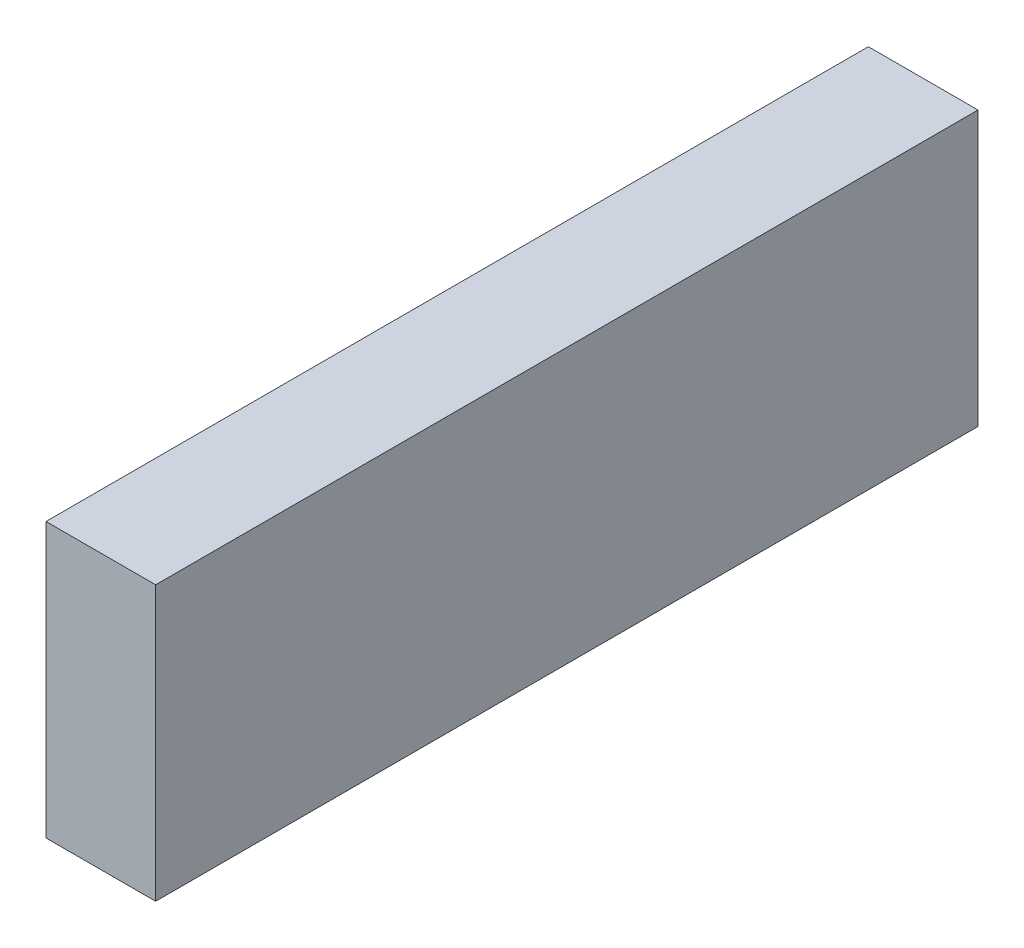
ISO-10303-21;
HEADER;
FILE_DESCRIPTION(('STEP AP214'),'2;1');
FILE_NAME('part.step','',(''),(''),'','','');
FILE_SCHEMA(('AUTOMOTIVE_DESIGN { 1 0 10303 214 1 1 1 1 }'));
ENDSEC;
DATA;
#1=APPLICATION_CONTEXT('core data for automotive mechanical design processes');
#2=APPLICATION_PROTOCOL_DEFINITION('international standard','automotive_design',2000,#1);
#3=PRODUCT_CONTEXT('',#1,'mechanical');
#4=PRODUCT('Part','Part','',(#3));
#5=PRODUCT_RELATED_PRODUCT_CATEGORY('part','',(#4));
#6=PRODUCT_DEFINITION_FORMATION('','',#4);
#7=PRODUCT_DEFINITION_CONTEXT('part definition',#1,'design');
#8=PRODUCT_DEFINITION('design','',#6,#7);
#9=PRODUCT_DEFINITION_SHAPE('','',#8);
#10=(LENGTH_UNIT() NAMED_UNIT(*) SI_UNIT(.MILLI.,.METRE.));
#11=(NAMED_UNIT(*) PLANE_ANGLE_UNIT() SI_UNIT($,.RADIAN.));
#12=(NAMED_UNIT(*) SI_UNIT($,.STERADIAN.) SOLID_ANGLE_UNIT());
#13=UNCERTAINTY_MEASURE_WITH_UNIT(LENGTH_MEASURE(1.E-05),#10,'distance_accuracy_value','');
#14=(GEOMETRIC_REPRESENTATION_CONTEXT(3) GLOBAL_UNCERTAINTY_ASSIGNED_CONTEXT((#13)) GLOBAL_UNIT_ASSIGNED_CONTEXT((#10,
#11,#12)) REPRESENTATION_CONTEXT('',''));
#15=CARTESIAN_POINT('',(0.,0.,0.));
#16=DIRECTION('',(0.,0.,1.));
#17=DIRECTION('',(1.,0.,0.));
#18=AXIS2_PLACEMENT_3D('',#15,#16,#17);
#19=CARTESIAN_POINT('',(40.,50.,-150.));
#20=DIRECTION('',(0.,0.,1.));
#21=DIRECTION('',(1.,0.,0.));
#22=AXIS2_PLACEMENT_3D('',#19,#20,#21);
#23=PLANE('',#22);
#24=DIRECTION('',(0.,1.,0.));
#25=VECTOR('',#24,1.);
#26=CARTESIAN_POINT('',(0.,50.,-150.));
#27=LINE('',#26,#25);
#28=CARTESIAN_POINT('',(0.,-50.,-150.));
#29=VERTEX_POINT('',#28);
#30=CARTESIAN_POINT('',(0.,50.,-150.));
#31=VERTEX_POINT('',#30);
#32=EDGE_CURVE('E113',#29,#31,#27,.T.);
#33=ORIENTED_EDGE('',*,*,#32,.T.);
#34=DIRECTION('',(-1.,0.,0.));
#35=VECTOR('',#34,1.);
#36=CARTESIAN_POINT('',(40.,50.,-150.));
#37=LINE('',#36,#35);
#38=CARTESIAN_POINT('',(40.,50.,-150.));
#39=VERTEX_POINT('',#38);
#40=EDGE_CURVE('E11',#39,#31,#37,.T.);
#41=ORIENTED_EDGE('',*,*,#40,.F.);
#42=DIRECTION('',(0.,1.,0.));
#43=VECTOR('',#42,1.);
#44=CARTESIAN_POINT('',(40.,50.,-150.));
#45=LINE('',#44,#43);
#46=CARTESIAN_POINT('',(40.,-50.,-150.));
#47=VERTEX_POINT('',#46);
#48=EDGE_CURVE('E97',#47,#39,#45,.T.);
#49=ORIENTED_EDGE('',*,*,#48,.F.);
#50=DIRECTION('',(-1.,0.,0.));
#51=VECTOR('',#50,1.);
#52=CARTESIAN_POINT('',(40.,-50.,-150.));
#53=LINE('',#52,#51);
#54=EDGE_CURVE('E109',#47,#29,#53,.T.);
#55=ORIENTED_EDGE('',*,*,#54,.T.);
#56=EDGE_LOOP('',(#33,#41,#49,#55));
#57=FACE_BOUND('',#56,.T.);
#58=ADVANCED_FACE('F45',(#57),#23,.F.);
#59=CARTESIAN_POINT('',(40.,50.,150.));
#60=DIRECTION('',(0.,-1.,0.));
#61=DIRECTION('',(0.,0.,-1.));
#62=AXIS2_PLACEMENT_3D('',#59,#60,#61);
#63=PLANE('',#62);
#64=DIRECTION('',(0.,0.,1.));
#65=VECTOR('',#64,1.);
#66=CARTESIAN_POINT('',(0.,50.,150.));
#67=LINE('',#66,#65);
#68=CARTESIAN_POINT('',(0.,50.,150.));
#69=VERTEX_POINT('',#68);
#70=EDGE_CURVE('E102',#31,#69,#67,.T.);
#71=ORIENTED_EDGE('',*,*,#70,.T.);
#72=DIRECTION('',(-1.,0.,0.));
#73=VECTOR('',#72,1.);
#74=CARTESIAN_POINT('',(40.,50.,150.));
#75=LINE('',#74,#73);
#76=CARTESIAN_POINT('',(40.,50.,150.));
#77=VERTEX_POINT('',#76);
#78=EDGE_CURVE('E54',#77,#69,#75,.T.);
#79=ORIENTED_EDGE('',*,*,#78,.F.);
#80=DIRECTION('',(0.,0.,1.));
#81=VECTOR('',#80,1.);
#82=CARTESIAN_POINT('',(40.,50.,150.));
#83=LINE('',#82,#81);
#84=EDGE_CURVE('E92',#39,#77,#83,.T.);
#85=ORIENTED_EDGE('',*,*,#84,.F.);
#86=ORIENTED_EDGE('',*,*,#40,.T.);
#87=EDGE_LOOP('',(#71,#79,#85,#86));
#88=FACE_BOUND('',#87,.T.);
#89=ADVANCED_FACE('F101',(#88),#63,.F.);
#90=CARTESIAN_POINT('',(40.,50.,150.));
#91=DIRECTION('',(0.,0.,-1.));
#92=DIRECTION('',(0.,1.,0.));
#93=AXIS2_PLACEMENT_3D('',#90,#91,#92);
#94=PLANE('',#93);
#95=DIRECTION('',(0.,-1.,0.));
#96=VECTOR('',#95,1.);
#97=CARTESIAN_POINT('',(0.,50.,150.));
#98=LINE('',#97,#96);
#99=CARTESIAN_POINT('',(0.,-50.,150.));
#100=VERTEX_POINT('',#99);
#101=EDGE_CURVE('E79',#69,#100,#98,.T.);
#102=ORIENTED_EDGE('',*,*,#101,.T.);
#103=DIRECTION('',(-1.,0.,0.));
#104=VECTOR('',#103,1.);
#105=CARTESIAN_POINT('',(40.,-50.,150.));
#106=LINE('',#105,#104);
#107=CARTESIAN_POINT('',(40.,-50.,150.));
#108=VERTEX_POINT('',#107);
#109=EDGE_CURVE('E104',#108,#100,#106,.T.);
#110=ORIENTED_EDGE('',*,*,#109,.F.);
#111=DIRECTION('',(0.,-1.,0.));
#112=VECTOR('',#111,1.);
#113=CARTESIAN_POINT('',(40.,50.,150.));
#114=LINE('',#113,#112);
#115=EDGE_CURVE('E95',#77,#108,#114,.T.);
#116=ORIENTED_EDGE('',*,*,#115,.F.);
#117=ORIENTED_EDGE('',*,*,#78,.T.);
#118=EDGE_LOOP('',(#102,#110,#116,#117));
#119=FACE_BOUND('',#118,.T.);
#120=ADVANCED_FACE('F105',(#119),#94,.F.);
#121=CARTESIAN_POINT('',(40.,-50.,150.));
#122=DIRECTION('',(0.,1.,0.));
#123=DIRECTION('',(0.,0.,1.));
#124=AXIS2_PLACEMENT_3D('',#121,#122,#123);
#125=PLANE('',#124);
#126=DIRECTION('',(0.,0.,-1.));
#127=VECTOR('',#126,1.);
#128=CARTESIAN_POINT('',(0.,-50.,150.));
#129=LINE('',#128,#127);
#130=EDGE_CURVE('E85',#100,#29,#129,.T.);
#131=ORIENTED_EDGE('',*,*,#130,.T.);
#132=ORIENTED_EDGE('',*,*,#54,.F.);
#133=DIRECTION('',(0.,0.,-1.));
#134=VECTOR('',#133,1.);
#135=CARTESIAN_POINT('',(40.,-50.,150.));
#136=LINE('',#135,#134);
#137=EDGE_CURVE('E62',#108,#47,#136,.T.);
#138=ORIENTED_EDGE('',*,*,#137,.F.);
#139=ORIENTED_EDGE('',*,*,#109,.T.);
#140=EDGE_LOOP('',(#131,#132,#138,#139));
#141=FACE_BOUND('',#140,.T.);
#142=ADVANCED_FACE('F126',(#141),#125,.F.);
#143=CARTESIAN_POINT('',(40.,0.,0.));
#144=DIRECTION('',(1.,0.,0.));
#145=DIRECTION('',(0.,0.,-1.));
#146=AXIS2_PLACEMENT_3D('',#143,#144,#145);
#147=PLANE('',#146);
#148=ORIENTED_EDGE('',*,*,#48,.T.);
#149=ORIENTED_EDGE('',*,*,#84,.T.);
#150=ORIENTED_EDGE('',*,*,#115,.T.);
#151=ORIENTED_EDGE('',*,*,#137,.T.);
#152=EDGE_LOOP('',(#148,#149,#150,#151));
#153=FACE_BOUND('',#152,.T.);
#154=ADVANCED_FACE('F93',(#153),#147,.T.);
#155=CARTESIAN_POINT('',(0.,0.,0.));
#156=DIRECTION('',(1.,0.,0.));
#157=DIRECTION('',(0.,0.,-1.));
#158=AXIS2_PLACEMENT_3D('',#155,#156,#157);
#159=PLANE('',#158);
#160=ORIENTED_EDGE('',*,*,#32,.F.);
#161=ORIENTED_EDGE('',*,*,#130,.F.);
#162=ORIENTED_EDGE('',*,*,#101,.F.);
#163=ORIENTED_EDGE('',*,*,#70,.F.);
#164=EDGE_LOOP('',(#160,#161,#162,#163));
#165=FACE_BOUND('',#164,.T.);
#166=ADVANCED_FACE('F129',(#165),#159,.F.);
#167=CLOSED_SHELL('',(#58,#89,#120,#142,#154,#166));
#168=MANIFOLD_SOLID_BREP('B2',#167);
#169=ADVANCED_BREP_SHAPE_REPRESENTATION('',(#18,#168),#14);
#170=SHAPE_DEFINITION_REPRESENTATION(#9,#169);
ENDSEC;
END-ISO-10303-21;
